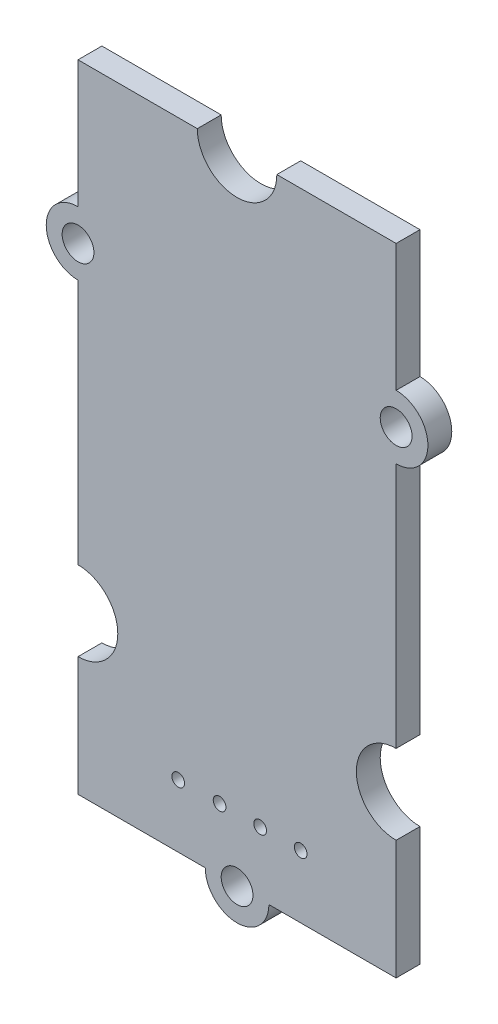
ISO-10303-21;
HEADER;
FILE_DESCRIPTION(('STEP AP214'),'2;1');
FILE_NAME('part.step','',(''),(''),'','','');
FILE_SCHEMA(('AUTOMOTIVE_DESIGN { 1 0 10303 214 1 1 1 1 }'));
ENDSEC;
DATA;
#1=APPLICATION_CONTEXT('core data for automotive mechanical design processes');
#2=APPLICATION_PROTOCOL_DEFINITION('international standard','automotive_design',2000,#1);
#3=PRODUCT_CONTEXT('',#1,'mechanical');
#4=PRODUCT('Part','Part','',(#3));
#5=PRODUCT_RELATED_PRODUCT_CATEGORY('part','',(#4));
#6=PRODUCT_DEFINITION_FORMATION('','',#4);
#7=PRODUCT_DEFINITION_CONTEXT('part definition',#1,'design');
#8=PRODUCT_DEFINITION('design','',#6,#7);
#9=PRODUCT_DEFINITION_SHAPE('','',#8);
#10=(LENGTH_UNIT() NAMED_UNIT(*) SI_UNIT(.MILLI.,.METRE.));
#11=(NAMED_UNIT(*) PLANE_ANGLE_UNIT() SI_UNIT($,.RADIAN.));
#12=(NAMED_UNIT(*) SI_UNIT($,.STERADIAN.) SOLID_ANGLE_UNIT());
#13=UNCERTAINTY_MEASURE_WITH_UNIT(LENGTH_MEASURE(1.E-05),#10,'distance_accuracy_value','');
#14=(GEOMETRIC_REPRESENTATION_CONTEXT(3) GLOBAL_UNCERTAINTY_ASSIGNED_CONTEXT((#13)) GLOBAL_UNIT_ASSIGNED_CONTEXT((#10,
#11,#12)) REPRESENTATION_CONTEXT('',''));
#15=CARTESIAN_POINT('',(0.,0.,0.));
#16=DIRECTION('',(0.,0.,1.));
#17=DIRECTION('',(1.,0.,0.));
#18=AXIS2_PLACEMENT_3D('',#15,#16,#17);
#19=CARTESIAN_POINT('',(-10.,0.,1.5));
#20=DIRECTION('',(1.,0.,0.));
#21=DIRECTION('',(0.,0.,-1.));
#22=AXIS2_PLACEMENT_3D('',#19,#20,#21);
#23=PLANE('',#22);
#24=DIRECTION('',(0.,-1.,0.));
#25=VECTOR('',#24,1.);
#26=CARTESIAN_POINT('',(-10.,0.,0.));
#27=LINE('',#26,#25);
#28=CARTESIAN_POINT('',(-10.,7.5,0.));
#29=VERTEX_POINT('',#28);
#30=CARTESIAN_POINT('',(-10.,0.,0.));
#31=VERTEX_POINT('',#30);
#32=EDGE_CURVE('E180',#29,#31,#27,.T.);
#33=ORIENTED_EDGE('',*,*,#32,.T.);
#34=DIRECTION('',(0.,0.,-1.));
#35=VECTOR('',#34,1.);
#36=CARTESIAN_POINT('',(-10.,0.,1.5));
#37=LINE('',#36,#35);
#38=CARTESIAN_POINT('',(-10.,0.,1.5));
#39=VERTEX_POINT('',#38);
#40=EDGE_CURVE('E11',#39,#31,#37,.T.);
#41=ORIENTED_EDGE('',*,*,#40,.F.);
#42=DIRECTION('',(0.,-1.,0.));
#43=VECTOR('',#42,1.);
#44=CARTESIAN_POINT('',(-10.,0.,1.5));
#45=LINE('',#44,#43);
#46=CARTESIAN_POINT('',(-10.,7.5,1.5));
#47=VERTEX_POINT('',#46);
#48=EDGE_CURVE('E211',#47,#39,#45,.T.);
#49=ORIENTED_EDGE('',*,*,#48,.F.);
#50=DIRECTION('',(0.,0.,-1.));
#51=VECTOR('',#50,1.);
#52=CARTESIAN_POINT('',(-10.,7.5,1.5));
#53=LINE('',#52,#51);
#54=EDGE_CURVE('E176',#47,#29,#53,.T.);
#55=ORIENTED_EDGE('',*,*,#54,.T.);
#56=EDGE_LOOP('',(#33,#41,#49,#55));
#57=FACE_BOUND('',#56,.T.);
#58=ADVANCED_FACE('F36',(#57),#23,.F.);
#59=CARTESIAN_POINT('',(-10.,0.,1.5));
#60=DIRECTION('',(0.,1.,0.));
#61=DIRECTION('',(0.,0.,1.));
#62=AXIS2_PLACEMENT_3D('',#59,#60,#61);
#63=PLANE('',#62);
#64=DIRECTION('',(1.,0.,0.));
#65=VECTOR('',#64,1.);
#66=CARTESIAN_POINT('',(-10.,0.,0.));
#67=LINE('',#66,#65);
#68=CARTESIAN_POINT('',(-2.,0.,0.));
#69=VERTEX_POINT('',#68);
#70=EDGE_CURVE('E183',#31,#69,#67,.T.);
#71=ORIENTED_EDGE('',*,*,#70,.T.);
#72=DIRECTION('',(0.,0.,-1.));
#73=VECTOR('',#72,1.);
#74=CARTESIAN_POINT('',(-2.,0.,1.5));
#75=LINE('',#74,#73);
#76=CARTESIAN_POINT('',(-2.,0.,1.5));
#77=VERTEX_POINT('',#76);
#78=EDGE_CURVE('E44',#77,#69,#75,.T.);
#79=ORIENTED_EDGE('',*,*,#78,.F.);
#80=DIRECTION('',(1.,0.,0.));
#81=VECTOR('',#80,1.);
#82=CARTESIAN_POINT('',(-10.,0.,1.5));
#83=LINE('',#82,#81);
#84=EDGE_CURVE('E119',#39,#77,#83,.T.);
#85=ORIENTED_EDGE('',*,*,#84,.F.);
#86=ORIENTED_EDGE('',*,*,#40,.T.);
#87=EDGE_LOOP('',(#71,#79,#85,#86));
#88=FACE_BOUND('',#87,.T.);
#89=ADVANCED_FACE('F310',(#88),#63,.F.);
#90=CARTESIAN_POINT('',(0.,0.,1.5));
#91=DIRECTION('',(0.,0.,-1.));
#92=DIRECTION('',(-1.,0.,0.));
#93=AXIS2_PLACEMENT_3D('',#90,#91,#92);
#94=CYLINDRICAL_SURFACE('',#93,2.);
#95=CARTESIAN_POINT('',(0.,0.,0.));
#96=DIRECTION('',(0.,0.,1.));
#97=DIRECTION('',(1.,0.,0.));
#98=AXIS2_PLACEMENT_3D('',#95,#96,#97);
#99=CIRCLE('',#98,2.);
#100=CARTESIAN_POINT('',(2.,0.,0.));
#101=VERTEX_POINT('',#100);
#102=EDGE_CURVE('E186',#69,#101,#99,.T.);
#103=ORIENTED_EDGE('',*,*,#102,.T.);
#104=DIRECTION('',(0.,0.,-1.));
#105=VECTOR('',#104,1.);
#106=CARTESIAN_POINT('',(2.,0.,1.5));
#107=LINE('',#106,#105);
#108=CARTESIAN_POINT('',(2.,0.,1.5));
#109=VERTEX_POINT('',#108);
#110=EDGE_CURVE('E242',#109,#101,#107,.T.);
#111=ORIENTED_EDGE('',*,*,#110,.F.);
#112=CARTESIAN_POINT('',(0.,0.,1.5));
#113=DIRECTION('',(0.,0.,1.));
#114=DIRECTION('',(1.,0.,0.));
#115=AXIS2_PLACEMENT_3D('',#112,#113,#114);
#116=CIRCLE('',#115,2.);
#117=EDGE_CURVE('E250',#77,#109,#116,.T.);
#118=ORIENTED_EDGE('',*,*,#117,.F.);
#119=ORIENTED_EDGE('',*,*,#78,.T.);
#120=EDGE_LOOP('',(#103,#111,#118,#119));
#121=FACE_BOUND('',#120,.T.);
#122=ADVANCED_FACE('F248',(#121),#94,.T.);
#123=CARTESIAN_POINT('',(10.,0.,1.5));
#124=DIRECTION('',(0.,1.,0.));
#125=DIRECTION('',(0.,0.,1.));
#126=AXIS2_PLACEMENT_3D('',#123,#124,#125);
#127=PLANE('',#126);
#128=DIRECTION('',(1.,0.,0.));
#129=VECTOR('',#128,1.);
#130=CARTESIAN_POINT('',(10.,0.,0.));
#131=LINE('',#130,#129);
#132=CARTESIAN_POINT('',(10.,0.,0.));
#133=VERTEX_POINT('',#132);
#134=EDGE_CURVE('E188',#101,#133,#131,.T.);
#135=ORIENTED_EDGE('',*,*,#134,.T.);
#136=DIRECTION('',(0.,0.,-1.));
#137=VECTOR('',#136,1.);
#138=CARTESIAN_POINT('',(10.,0.,1.5));
#139=LINE('',#138,#137);
#140=CARTESIAN_POINT('',(10.,0.,1.5));
#141=VERTEX_POINT('',#140);
#142=EDGE_CURVE('E239',#141,#133,#139,.T.);
#143=ORIENTED_EDGE('',*,*,#142,.F.);
#144=DIRECTION('',(1.,0.,0.));
#145=VECTOR('',#144,1.);
#146=CARTESIAN_POINT('',(10.,0.,1.5));
#147=LINE('',#146,#145);
#148=EDGE_CURVE('E268',#109,#141,#147,.T.);
#149=ORIENTED_EDGE('',*,*,#148,.F.);
#150=ORIENTED_EDGE('',*,*,#110,.T.);
#151=EDGE_LOOP('',(#135,#143,#149,#150));
#152=FACE_BOUND('',#151,.T.);
#153=ADVANCED_FACE('F259',(#152),#127,.F.);
#154=CARTESIAN_POINT('',(10.,0.,1.5));
#155=DIRECTION('',(-1.,0.,0.));
#156=DIRECTION('',(0.,0.,1.));
#157=AXIS2_PLACEMENT_3D('',#154,#155,#156);
#158=PLANE('',#157);
#159=DIRECTION('',(0.,1.,0.));
#160=VECTOR('',#159,1.);
#161=CARTESIAN_POINT('',(10.,0.,0.));
#162=LINE('',#161,#160);
#163=CARTESIAN_POINT('',(10.,7.5,0.));
#164=VERTEX_POINT('',#163);
#165=EDGE_CURVE('E190',#133,#164,#162,.T.);
#166=ORIENTED_EDGE('',*,*,#165,.T.);
#167=DIRECTION('',(0.,0.,-1.));
#168=VECTOR('',#167,1.);
#169=CARTESIAN_POINT('',(10.,7.5,1.5));
#170=LINE('',#169,#168);
#171=CARTESIAN_POINT('',(10.,7.5,1.5));
#172=VERTEX_POINT('',#171);
#173=EDGE_CURVE('E236',#172,#164,#170,.T.);
#174=ORIENTED_EDGE('',*,*,#173,.F.);
#175=DIRECTION('',(0.,1.,0.));
#176=VECTOR('',#175,1.);
#177=CARTESIAN_POINT('',(10.,0.,1.5));
#178=LINE('',#177,#176);
#179=EDGE_CURVE('E265',#141,#172,#178,.T.);
#180=ORIENTED_EDGE('',*,*,#179,.F.);
#181=ORIENTED_EDGE('',*,*,#142,.T.);
#182=EDGE_LOOP('',(#166,#174,#180,#181));
#183=FACE_BOUND('',#182,.T.);
#184=ADVANCED_FACE('F263',(#183),#158,.F.);
#185=CARTESIAN_POINT('',(10.,10.,1.5));
#186=DIRECTION('',(0.,0.,-1.));
#187=DIRECTION('',(-1.,0.,0.));
#188=AXIS2_PLACEMENT_3D('',#185,#186,#187);
#189=CYLINDRICAL_SURFACE('',#188,2.5);
#190=CARTESIAN_POINT('',(10.,10.,0.));
#191=DIRECTION('',(0.,0.,-1.));
#192=DIRECTION('',(1.,0.,0.));
#193=AXIS2_PLACEMENT_3D('',#190,#191,#192);
#194=CIRCLE('',#193,2.5);
#195=CARTESIAN_POINT('',(10.,12.5,0.));
#196=VERTEX_POINT('',#195);
#197=EDGE_CURVE('E192',#164,#196,#194,.T.);
#198=ORIENTED_EDGE('',*,*,#197,.T.);
#199=DIRECTION('',(0.,0.,-1.));
#200=VECTOR('',#199,1.);
#201=CARTESIAN_POINT('',(10.,12.5,1.5));
#202=LINE('',#201,#200);
#203=CARTESIAN_POINT('',(10.,12.5,1.5));
#204=VERTEX_POINT('',#203);
#205=EDGE_CURVE('E233',#204,#196,#202,.T.);
#206=ORIENTED_EDGE('',*,*,#205,.F.);
#207=CARTESIAN_POINT('',(10.,10.,1.5));
#208=DIRECTION('',(0.,0.,-1.));
#209=DIRECTION('',(1.,0.,0.));
#210=AXIS2_PLACEMENT_3D('',#207,#208,#209);
#211=CIRCLE('',#210,2.5);
#212=EDGE_CURVE('E267',#172,#204,#211,.T.);
#213=ORIENTED_EDGE('',*,*,#212,.F.);
#214=ORIENTED_EDGE('',*,*,#173,.T.);
#215=EDGE_LOOP('',(#198,#206,#213,#214));
#216=FACE_BOUND('',#215,.T.);
#217=ADVANCED_FACE('F323',(#216),#189,.F.);
#218=CARTESIAN_POINT('',(10.,12.5,1.5));
#219=DIRECTION('',(-1.,0.,0.));
#220=DIRECTION('',(0.,0.,1.));
#221=AXIS2_PLACEMENT_3D('',#218,#219,#220);
#222=PLANE('',#221);
#223=DIRECTION('',(0.,1.,0.));
#224=VECTOR('',#223,1.);
#225=CARTESIAN_POINT('',(10.,12.5,0.));
#226=LINE('',#225,#224);
#227=CARTESIAN_POINT('',(10.,28.,0.));
#228=VERTEX_POINT('',#227);
#229=EDGE_CURVE('E194',#196,#228,#226,.T.);
#230=ORIENTED_EDGE('',*,*,#229,.T.);
#231=DIRECTION('',(0.,0.,-1.));
#232=VECTOR('',#231,1.);
#233=CARTESIAN_POINT('',(10.,28.,1.5));
#234=LINE('',#233,#232);
#235=CARTESIAN_POINT('',(10.,28.,1.5));
#236=VERTEX_POINT('',#235);
#237=EDGE_CURVE('E230',#236,#228,#234,.T.);
#238=ORIENTED_EDGE('',*,*,#237,.F.);
#239=DIRECTION('',(0.,1.,0.));
#240=VECTOR('',#239,1.);
#241=CARTESIAN_POINT('',(10.,12.5,1.5));
#242=LINE('',#241,#240);
#243=EDGE_CURVE('E270',#204,#236,#242,.T.);
#244=ORIENTED_EDGE('',*,*,#243,.F.);
#245=ORIENTED_EDGE('',*,*,#205,.T.);
#246=EDGE_LOOP('',(#230,#238,#244,#245));
#247=FACE_BOUND('',#246,.T.);
#248=ADVANCED_FACE('F326',(#247),#222,.F.);
#249=CARTESIAN_POINT('',(10.,30.,1.5));
#250=DIRECTION('',(0.,0.,-1.));
#251=DIRECTION('',(-1.,0.,0.));
#252=AXIS2_PLACEMENT_3D('',#249,#250,#251);
#253=CYLINDRICAL_SURFACE('',#252,2.);
#254=CARTESIAN_POINT('',(10.,30.,0.));
#255=DIRECTION('',(0.,0.,1.));
#256=DIRECTION('',(-1.,0.,0.));
#257=AXIS2_PLACEMENT_3D('',#254,#255,#256);
#258=CIRCLE('',#257,2.);
#259=CARTESIAN_POINT('',(10.,32.,0.));
#260=VERTEX_POINT('',#259);
#261=EDGE_CURVE('E196',#228,#260,#258,.T.);
#262=ORIENTED_EDGE('',*,*,#261,.T.);
#263=DIRECTION('',(0.,0.,-1.));
#264=VECTOR('',#263,1.);
#265=CARTESIAN_POINT('',(10.,32.,1.5));
#266=LINE('',#265,#264);
#267=CARTESIAN_POINT('',(10.,32.,1.5));
#268=VERTEX_POINT('',#267);
#269=EDGE_CURVE('E227',#268,#260,#266,.T.);
#270=ORIENTED_EDGE('',*,*,#269,.F.);
#271=CARTESIAN_POINT('',(10.,30.,1.5));
#272=DIRECTION('',(0.,0.,1.));
#273=DIRECTION('',(-1.,0.,0.));
#274=AXIS2_PLACEMENT_3D('',#271,#272,#273);
#275=CIRCLE('',#274,2.);
#276=EDGE_CURVE('E276',#236,#268,#275,.T.);
#277=ORIENTED_EDGE('',*,*,#276,.F.);
#278=ORIENTED_EDGE('',*,*,#237,.T.);
#279=EDGE_LOOP('',(#262,#270,#277,#278));
#280=FACE_BOUND('',#279,.T.);
#281=ADVANCED_FACE('F330',(#280),#253,.T.);
#282=CARTESIAN_POINT('',(10.,40.,1.5));
#283=DIRECTION('',(-1.,0.,0.));
#284=DIRECTION('',(0.,0.,1.));
#285=AXIS2_PLACEMENT_3D('',#282,#283,#284);
#286=PLANE('',#285);
#287=DIRECTION('',(0.,1.,0.));
#288=VECTOR('',#287,1.);
#289=CARTESIAN_POINT('',(10.,40.,0.));
#290=LINE('',#289,#288);
#291=CARTESIAN_POINT('',(10.,40.,0.));
#292=VERTEX_POINT('',#291);
#293=EDGE_CURVE('E198',#260,#292,#290,.T.);
#294=ORIENTED_EDGE('',*,*,#293,.T.);
#295=DIRECTION('',(0.,0.,-1.));
#296=VECTOR('',#295,1.);
#297=CARTESIAN_POINT('',(10.,40.,1.5));
#298=LINE('',#297,#296);
#299=CARTESIAN_POINT('',(10.,40.,1.5));
#300=VERTEX_POINT('',#299);
#301=EDGE_CURVE('E224',#300,#292,#298,.T.);
#302=ORIENTED_EDGE('',*,*,#301,.F.);
#303=DIRECTION('',(0.,1.,0.));
#304=VECTOR('',#303,1.);
#305=CARTESIAN_POINT('',(10.,40.,1.5));
#306=LINE('',#305,#304);
#307=EDGE_CURVE('E278',#268,#300,#306,.T.);
#308=ORIENTED_EDGE('',*,*,#307,.F.);
#309=ORIENTED_EDGE('',*,*,#269,.T.);
#310=EDGE_LOOP('',(#294,#302,#308,#309));
#311=FACE_BOUND('',#310,.T.);
#312=ADVANCED_FACE('F334',(#311),#286,.F.);
#313=CARTESIAN_POINT('',(10.,40.,1.5));
#314=DIRECTION('',(0.,-1.,0.));
#315=DIRECTION('',(0.,0.,-1.));
#316=AXIS2_PLACEMENT_3D('',#313,#314,#315);
#317=PLANE('',#316);
#318=DIRECTION('',(-1.,0.,0.));
#319=VECTOR('',#318,1.);
#320=CARTESIAN_POINT('',(10.,40.,0.));
#321=LINE('',#320,#319);
#322=CARTESIAN_POINT('',(2.5,40.,0.));
#323=VERTEX_POINT('',#322);
#324=EDGE_CURVE('E200',#292,#323,#321,.T.);
#325=ORIENTED_EDGE('',*,*,#324,.T.);
#326=DIRECTION('',(0.,0.,-1.));
#327=VECTOR('',#326,1.);
#328=CARTESIAN_POINT('',(2.5,40.,1.5));
#329=LINE('',#328,#327);
#330=CARTESIAN_POINT('',(2.5,40.,1.5));
#331=VERTEX_POINT('',#330);
#332=EDGE_CURVE('E221',#331,#323,#329,.T.);
#333=ORIENTED_EDGE('',*,*,#332,.F.);
#334=DIRECTION('',(-1.,0.,0.));
#335=VECTOR('',#334,1.);
#336=CARTESIAN_POINT('',(10.,40.,1.5));
#337=LINE('',#336,#335);
#338=EDGE_CURVE('E280',#300,#331,#337,.T.);
#339=ORIENTED_EDGE('',*,*,#338,.F.);
#340=ORIENTED_EDGE('',*,*,#301,.T.);
#341=EDGE_LOOP('',(#325,#333,#339,#340));
#342=FACE_BOUND('',#341,.T.);
#343=ADVANCED_FACE('F338',(#342),#317,.F.);
#344=CARTESIAN_POINT('',(0.,40.,1.5));
#345=DIRECTION('',(0.,0.,-1.));
#346=DIRECTION('',(-1.,0.,0.));
#347=AXIS2_PLACEMENT_3D('',#344,#345,#346);
#348=CYLINDRICAL_SURFACE('',#347,2.5);
#349=CARTESIAN_POINT('',(0.,40.,0.));
#350=DIRECTION('',(0.,0.,-1.));
#351=DIRECTION('',(1.,0.,0.));
#352=AXIS2_PLACEMENT_3D('',#349,#350,#351);
#353=CIRCLE('',#352,2.5);
#354=CARTESIAN_POINT('',(-2.5,40.,0.));
#355=VERTEX_POINT('',#354);
#356=EDGE_CURVE('E202',#323,#355,#353,.T.);
#357=ORIENTED_EDGE('',*,*,#356,.T.);
#358=DIRECTION('',(0.,0.,-1.));
#359=VECTOR('',#358,1.);
#360=CARTESIAN_POINT('',(-2.5,40.,1.5));
#361=LINE('',#360,#359);
#362=CARTESIAN_POINT('',(-2.5,40.,1.5));
#363=VERTEX_POINT('',#362);
#364=EDGE_CURVE('E218',#363,#355,#361,.T.);
#365=ORIENTED_EDGE('',*,*,#364,.F.);
#366=CARTESIAN_POINT('',(0.,40.,1.5));
#367=DIRECTION('',(0.,0.,-1.));
#368=DIRECTION('',(1.,0.,0.));
#369=AXIS2_PLACEMENT_3D('',#366,#367,#368);
#370=CIRCLE('',#369,2.5);
#371=EDGE_CURVE('E282',#331,#363,#370,.T.);
#372=ORIENTED_EDGE('',*,*,#371,.F.);
#373=ORIENTED_EDGE('',*,*,#332,.T.);
#374=EDGE_LOOP('',(#357,#365,#372,#373));
#375=FACE_BOUND('',#374,.T.);
#376=ADVANCED_FACE('F342',(#375),#348,.F.);
#377=CARTESIAN_POINT('',(-10.,40.,1.5));
#378=DIRECTION('',(0.,-1.,0.));
#379=DIRECTION('',(0.,0.,-1.));
#380=AXIS2_PLACEMENT_3D('',#377,#378,#379);
#381=PLANE('',#380);
#382=DIRECTION('',(-1.,0.,0.));
#383=VECTOR('',#382,1.);
#384=CARTESIAN_POINT('',(-10.,40.,0.));
#385=LINE('',#384,#383);
#386=CARTESIAN_POINT('',(-10.,40.,0.));
#387=VERTEX_POINT('',#386);
#388=EDGE_CURVE('E204',#355,#387,#385,.T.);
#389=ORIENTED_EDGE('',*,*,#388,.T.);
#390=DIRECTION('',(0.,0.,-1.));
#391=VECTOR('',#390,1.);
#392=CARTESIAN_POINT('',(-10.,40.,1.5));
#393=LINE('',#392,#391);
#394=CARTESIAN_POINT('',(-10.,40.,1.5));
#395=VERTEX_POINT('',#394);
#396=EDGE_CURVE('E215',#395,#387,#393,.T.);
#397=ORIENTED_EDGE('',*,*,#396,.F.);
#398=DIRECTION('',(-1.,0.,0.));
#399=VECTOR('',#398,1.);
#400=CARTESIAN_POINT('',(-10.,40.,1.5));
#401=LINE('',#400,#399);
#402=EDGE_CURVE('E284',#363,#395,#401,.T.);
#403=ORIENTED_EDGE('',*,*,#402,.F.);
#404=ORIENTED_EDGE('',*,*,#364,.T.);
#405=EDGE_LOOP('',(#389,#397,#403,#404));
#406=FACE_BOUND('',#405,.T.);
#407=ADVANCED_FACE('F290',(#406),#381,.F.);
#408=CARTESIAN_POINT('',(-10.,40.,1.5));
#409=DIRECTION('',(1.,0.,0.));
#410=DIRECTION('',(0.,0.,-1.));
#411=AXIS2_PLACEMENT_3D('',#408,#409,#410);
#412=PLANE('',#411);
#413=DIRECTION('',(0.,-1.,0.));
#414=VECTOR('',#413,1.);
#415=CARTESIAN_POINT('',(-10.,40.,0.));
#416=LINE('',#415,#414);
#417=CARTESIAN_POINT('',(-10.,32.,0.));
#418=VERTEX_POINT('',#417);
#419=EDGE_CURVE('E206',#387,#418,#416,.T.);
#420=ORIENTED_EDGE('',*,*,#419,.T.);
#421=DIRECTION('',(0.,0.,-1.));
#422=VECTOR('',#421,1.);
#423=CARTESIAN_POINT('',(-10.,32.,1.5));
#424=LINE('',#423,#422);
#425=CARTESIAN_POINT('',(-10.,32.,1.5));
#426=VERTEX_POINT('',#425);
#427=EDGE_CURVE('E171',#426,#418,#424,.T.);
#428=ORIENTED_EDGE('',*,*,#427,.F.);
#429=DIRECTION('',(0.,-1.,0.));
#430=VECTOR('',#429,1.);
#431=CARTESIAN_POINT('',(-10.,40.,1.5));
#432=LINE('',#431,#430);
#433=EDGE_CURVE('E162',#395,#426,#432,.T.);
#434=ORIENTED_EDGE('',*,*,#433,.F.);
#435=ORIENTED_EDGE('',*,*,#396,.T.);
#436=EDGE_LOOP('',(#420,#428,#434,#435));
#437=FACE_BOUND('',#436,.T.);
#438=ADVANCED_FACE('F294',(#437),#412,.F.);
#439=CARTESIAN_POINT('',(-10.,30.,1.5));
#440=DIRECTION('',(0.,0.,-1.));
#441=DIRECTION('',(-1.,0.,0.));
#442=AXIS2_PLACEMENT_3D('',#439,#440,#441);
#443=CYLINDRICAL_SURFACE('',#442,2.);
#444=CARTESIAN_POINT('',(-10.,30.,0.));
#445=DIRECTION('',(0.,0.,1.));
#446=DIRECTION('',(1.,0.,0.));
#447=AXIS2_PLACEMENT_3D('',#444,#445,#446);
#448=CIRCLE('',#447,2.);
#449=CARTESIAN_POINT('',(-10.,28.,0.));
#450=VERTEX_POINT('',#449);
#451=EDGE_CURVE('E170',#418,#450,#448,.T.);
#452=ORIENTED_EDGE('',*,*,#451,.T.);
#453=DIRECTION('',(0.,0.,-1.));
#454=VECTOR('',#453,1.);
#455=CARTESIAN_POINT('',(-10.,28.,1.5));
#456=LINE('',#455,#454);
#457=CARTESIAN_POINT('',(-10.,28.,1.5));
#458=VERTEX_POINT('',#457);
#459=EDGE_CURVE('E167',#458,#450,#456,.T.);
#460=ORIENTED_EDGE('',*,*,#459,.F.);
#461=CARTESIAN_POINT('',(-10.,30.,1.5));
#462=DIRECTION('',(0.,0.,1.));
#463=DIRECTION('',(1.,0.,0.));
#464=AXIS2_PLACEMENT_3D('',#461,#462,#463);
#465=CIRCLE('',#464,2.);
#466=EDGE_CURVE('E156',#426,#458,#465,.T.);
#467=ORIENTED_EDGE('',*,*,#466,.F.);
#468=ORIENTED_EDGE('',*,*,#427,.T.);
#469=EDGE_LOOP('',(#452,#460,#467,#468));
#470=FACE_BOUND('',#469,.T.);
#471=ADVANCED_FACE('F168',(#470),#443,.T.);
#472=CARTESIAN_POINT('',(-10.,12.5,1.5));
#473=DIRECTION('',(1.,0.,0.));
#474=DIRECTION('',(0.,0.,-1.));
#475=AXIS2_PLACEMENT_3D('',#472,#473,#474);
#476=PLANE('',#475);
#477=DIRECTION('',(0.,-1.,0.));
#478=VECTOR('',#477,1.);
#479=CARTESIAN_POINT('',(-10.,12.5,0.));
#480=LINE('',#479,#478);
#481=CARTESIAN_POINT('',(-10.,12.5,0.));
#482=VERTEX_POINT('',#481);
#483=EDGE_CURVE('E105',#450,#482,#480,.T.);
#484=ORIENTED_EDGE('',*,*,#483,.T.);
#485=DIRECTION('',(0.,0.,-1.));
#486=VECTOR('',#485,1.);
#487=CARTESIAN_POINT('',(-10.,12.5,1.5));
#488=LINE('',#487,#486);
#489=CARTESIAN_POINT('',(-10.,12.5,1.5));
#490=VERTEX_POINT('',#489);
#491=EDGE_CURVE('E172',#490,#482,#488,.T.);
#492=ORIENTED_EDGE('',*,*,#491,.F.);
#493=DIRECTION('',(0.,-1.,0.));
#494=VECTOR('',#493,1.);
#495=CARTESIAN_POINT('',(-10.,12.5,1.5));
#496=LINE('',#495,#494);
#497=EDGE_CURVE('E160',#458,#490,#496,.T.);
#498=ORIENTED_EDGE('',*,*,#497,.F.);
#499=ORIENTED_EDGE('',*,*,#459,.T.);
#500=EDGE_LOOP('',(#484,#492,#498,#499));
#501=FACE_BOUND('',#500,.T.);
#502=ADVANCED_FACE('F174',(#501),#476,.F.);
#503=CARTESIAN_POINT('',(-10.,10.,1.5));
#504=DIRECTION('',(0.,0.,-1.));
#505=DIRECTION('',(-1.,0.,0.));
#506=AXIS2_PLACEMENT_3D('',#503,#504,#505);
#507=CYLINDRICAL_SURFACE('',#506,2.5);
#508=CARTESIAN_POINT('',(-10.,10.,0.));
#509=DIRECTION('',(0.,0.,-1.));
#510=DIRECTION('',(-1.,0.,0.));
#511=AXIS2_PLACEMENT_3D('',#508,#509,#510);
#512=CIRCLE('',#511,2.5);
#513=EDGE_CURVE('E111',#482,#29,#512,.T.);
#514=ORIENTED_EDGE('',*,*,#513,.T.);
#515=ORIENTED_EDGE('',*,*,#54,.F.);
#516=CARTESIAN_POINT('',(-10.,10.,1.5));
#517=DIRECTION('',(0.,0.,-1.));
#518=DIRECTION('',(-1.,0.,0.));
#519=AXIS2_PLACEMENT_3D('',#516,#517,#518);
#520=CIRCLE('',#519,2.5);
#521=EDGE_CURVE('E52',#490,#47,#520,.T.);
#522=ORIENTED_EDGE('',*,*,#521,.F.);
#523=ORIENTED_EDGE('',*,*,#491,.T.);
#524=EDGE_LOOP('',(#514,#515,#522,#523));
#525=FACE_BOUND('',#524,.T.);
#526=ADVANCED_FACE('F298',(#525),#507,.F.);
#527=CARTESIAN_POINT('',(-10.,10.,1.5));
#528=DIRECTION('',(0.,0.,-1.));
#529=DIRECTION('',(-1.,0.,0.));
#530=AXIS2_PLACEMENT_3D('',#527,#528,#529);
#531=PLANE('',#530);
#532=CARTESIAN_POINT('',(-3.7,3.94341720128032,1.5));
#533=DIRECTION('',(0.,0.,1.));
#534=DIRECTION('',(1.,0.,0.));
#535=AXIS2_PLACEMENT_3D('',#532,#533,#534);
#536=CIRCLE('',#535,0.4);
#537=CARTESIAN_POINT('',(-3.3,3.94341720128032,1.5));
#538=VERTEX_POINT('',#537);
#539=EDGE_CURVE('E460',#538,#538,#536,.T.);
#540=ORIENTED_EDGE('',*,*,#539,.F.);
#541=EDGE_LOOP('',(#540));
#542=FACE_BOUND('',#541,.T.);
#543=CARTESIAN_POINT('',(-1.1,3.94341720128032,1.5));
#544=DIRECTION('',(0.,0.,1.));
#545=DIRECTION('',(1.,0.,0.));
#546=AXIS2_PLACEMENT_3D('',#543,#544,#545);
#547=CIRCLE('',#546,0.4);
#548=CARTESIAN_POINT('',(-0.699999999999996,3.94341720128032,1.5));
#549=VERTEX_POINT('',#548);
#550=EDGE_CURVE('E462',#549,#549,#547,.T.);
#551=ORIENTED_EDGE('',*,*,#550,.F.);
#552=EDGE_LOOP('',(#551));
#553=FACE_BOUND('',#552,.T.);
#554=CARTESIAN_POINT('',(1.45,3.94341720128032,1.5));
#555=DIRECTION('',(0.,0.,1.));
#556=DIRECTION('',(1.,0.,0.));
#557=AXIS2_PLACEMENT_3D('',#554,#555,#556);
#558=CIRCLE('',#557,0.4);
#559=CARTESIAN_POINT('',(1.85,3.94341720128032,1.5));
#560=VERTEX_POINT('',#559);
#561=EDGE_CURVE('E468',#560,#560,#558,.T.);
#562=ORIENTED_EDGE('',*,*,#561,.F.);
#563=EDGE_LOOP('',(#562));
#564=FACE_BOUND('',#563,.T.);
#565=CARTESIAN_POINT('',(4.,3.94341720128032,1.5));
#566=DIRECTION('',(0.,0.,1.));
#567=DIRECTION('',(1.,0.,0.));
#568=AXIS2_PLACEMENT_3D('',#565,#566,#567);
#569=CIRCLE('',#568,0.4);
#570=CARTESIAN_POINT('',(4.4,3.94341720128032,1.5));
#571=VERTEX_POINT('',#570);
#572=EDGE_CURVE('E474',#571,#571,#569,.T.);
#573=ORIENTED_EDGE('',*,*,#572,.F.);
#574=EDGE_LOOP('',(#573));
#575=FACE_BOUND('',#574,.T.);
#576=CARTESIAN_POINT('',(0.,0.,1.5));
#577=DIRECTION('',(0.,0.,1.));
#578=DIRECTION('',(1.,0.,0.));
#579=AXIS2_PLACEMENT_3D('',#576,#577,#578);
#580=CIRCLE('',#579,1.);
#581=CARTESIAN_POINT('',(1.,0.,1.5));
#582=VERTEX_POINT('',#581);
#583=EDGE_CURVE('E480',#582,#582,#580,.T.);
#584=ORIENTED_EDGE('',*,*,#583,.F.);
#585=EDGE_LOOP('',(#584));
#586=FACE_BOUND('',#585,.T.);
#587=CARTESIAN_POINT('',(10.,30.,1.5));
#588=DIRECTION('',(0.,0.,1.));
#589=DIRECTION('',(-1.,0.,0.));
#590=AXIS2_PLACEMENT_3D('',#587,#588,#589);
#591=CIRCLE('',#590,1.);
#592=CARTESIAN_POINT('',(9.,30.,1.5));
#593=VERTEX_POINT('',#592);
#594=EDGE_CURVE('E486',#593,#593,#591,.T.);
#595=ORIENTED_EDGE('',*,*,#594,.F.);
#596=EDGE_LOOP('',(#595));
#597=FACE_BOUND('',#596,.T.);
#598=CARTESIAN_POINT('',(-10.,30.,1.5));
#599=DIRECTION('',(0.,0.,1.));
#600=DIRECTION('',(1.,0.,0.));
#601=AXIS2_PLACEMENT_3D('',#598,#599,#600);
#602=CIRCLE('',#601,1.);
#603=CARTESIAN_POINT('',(-9.,30.,1.5));
#604=VERTEX_POINT('',#603);
#605=EDGE_CURVE('E492',#604,#604,#602,.T.);
#606=ORIENTED_EDGE('',*,*,#605,.F.);
#607=EDGE_LOOP('',(#606));
#608=FACE_BOUND('',#607,.T.);
#609=ORIENTED_EDGE('',*,*,#48,.T.);
#610=ORIENTED_EDGE('',*,*,#84,.T.);
#611=ORIENTED_EDGE('',*,*,#117,.T.);
#612=ORIENTED_EDGE('',*,*,#148,.T.);
#613=ORIENTED_EDGE('',*,*,#179,.T.);
#614=ORIENTED_EDGE('',*,*,#212,.T.);
#615=ORIENTED_EDGE('',*,*,#243,.T.);
#616=ORIENTED_EDGE('',*,*,#276,.T.);
#617=ORIENTED_EDGE('',*,*,#307,.T.);
#618=ORIENTED_EDGE('',*,*,#338,.T.);
#619=ORIENTED_EDGE('',*,*,#371,.T.);
#620=ORIENTED_EDGE('',*,*,#402,.T.);
#621=ORIENTED_EDGE('',*,*,#433,.T.);
#622=ORIENTED_EDGE('',*,*,#466,.T.);
#623=ORIENTED_EDGE('',*,*,#497,.T.);
#624=ORIENTED_EDGE('',*,*,#521,.T.);
#625=EDGE_LOOP('',(#609,#610,#611,#612,#613,#614,#615,#616,#617,#618,#619,#620,#621,#622,#623,#624));
#626=FACE_BOUND('',#625,.T.);
#627=ADVANCED_FACE('F158',(#542,#553,#564,#575,#586,#597,#608,#626),#531,.F.);
#628=CARTESIAN_POINT('',(-10.,10.,0.));
#629=DIRECTION('',(0.,0.,-1.));
#630=DIRECTION('',(-1.,0.,0.));
#631=AXIS2_PLACEMENT_3D('',#628,#629,#630);
#632=PLANE('',#631);
#633=CARTESIAN_POINT('',(-3.7,3.94341720128032,0.));
#634=DIRECTION('',(0.,0.,1.));
#635=DIRECTION('',(1.,0.,0.));
#636=AXIS2_PLACEMENT_3D('',#633,#634,#635);
#637=CIRCLE('',#636,0.4);
#638=CARTESIAN_POINT('',(-3.3,3.94341720128032,0.));
#639=VERTEX_POINT('',#638);
#640=EDGE_CURVE('E457',#639,#639,#637,.T.);
#641=ORIENTED_EDGE('',*,*,#640,.T.);
#642=EDGE_LOOP('',(#641));
#643=FACE_BOUND('',#642,.T.);
#644=CARTESIAN_POINT('',(-1.1,3.94341720128032,0.));
#645=DIRECTION('',(0.,0.,1.));
#646=DIRECTION('',(1.,0.,0.));
#647=AXIS2_PLACEMENT_3D('',#644,#645,#646);
#648=CIRCLE('',#647,0.4);
#649=CARTESIAN_POINT('',(-0.699999999999996,3.94341720128032,0.));
#650=VERTEX_POINT('',#649);
#651=EDGE_CURVE('E465',#650,#650,#648,.T.);
#652=ORIENTED_EDGE('',*,*,#651,.T.);
#653=EDGE_LOOP('',(#652));
#654=FACE_BOUND('',#653,.T.);
#655=CARTESIAN_POINT('',(1.45,3.94341720128032,0.));
#656=DIRECTION('',(0.,0.,1.));
#657=DIRECTION('',(1.,0.,0.));
#658=AXIS2_PLACEMENT_3D('',#655,#656,#657);
#659=CIRCLE('',#658,0.4);
#660=CARTESIAN_POINT('',(1.85,3.94341720128032,0.));
#661=VERTEX_POINT('',#660);
#662=EDGE_CURVE('E471',#661,#661,#659,.T.);
#663=ORIENTED_EDGE('',*,*,#662,.T.);
#664=EDGE_LOOP('',(#663));
#665=FACE_BOUND('',#664,.T.);
#666=CARTESIAN_POINT('',(4.,3.94341720128032,0.));
#667=DIRECTION('',(0.,0.,1.));
#668=DIRECTION('',(1.,0.,0.));
#669=AXIS2_PLACEMENT_3D('',#666,#667,#668);
#670=CIRCLE('',#669,0.4);
#671=CARTESIAN_POINT('',(4.4,3.94341720128032,0.));
#672=VERTEX_POINT('',#671);
#673=EDGE_CURVE('E477',#672,#672,#670,.T.);
#674=ORIENTED_EDGE('',*,*,#673,.T.);
#675=EDGE_LOOP('',(#674));
#676=FACE_BOUND('',#675,.T.);
#677=CARTESIAN_POINT('',(0.,0.,0.));
#678=DIRECTION('',(0.,0.,1.));
#679=DIRECTION('',(1.,0.,0.));
#680=AXIS2_PLACEMENT_3D('',#677,#678,#679);
#681=CIRCLE('',#680,1.);
#682=CARTESIAN_POINT('',(1.,0.,0.));
#683=VERTEX_POINT('',#682);
#684=EDGE_CURVE('E483',#683,#683,#681,.T.);
#685=ORIENTED_EDGE('',*,*,#684,.T.);
#686=EDGE_LOOP('',(#685));
#687=FACE_BOUND('',#686,.T.);
#688=CARTESIAN_POINT('',(10.,30.,0.));
#689=DIRECTION('',(0.,0.,1.));
#690=DIRECTION('',(-1.,0.,0.));
#691=AXIS2_PLACEMENT_3D('',#688,#689,#690);
#692=CIRCLE('',#691,1.);
#693=CARTESIAN_POINT('',(9.,30.,0.));
#694=VERTEX_POINT('',#693);
#695=EDGE_CURVE('E489',#694,#694,#692,.T.);
#696=ORIENTED_EDGE('',*,*,#695,.T.);
#697=EDGE_LOOP('',(#696));
#698=FACE_BOUND('',#697,.T.);
#699=CARTESIAN_POINT('',(-10.,30.,0.));
#700=DIRECTION('',(0.,0.,1.));
#701=DIRECTION('',(1.,0.,0.));
#702=AXIS2_PLACEMENT_3D('',#699,#700,#701);
#703=CIRCLE('',#702,1.);
#704=CARTESIAN_POINT('',(-9.,30.,0.));
#705=VERTEX_POINT('',#704);
#706=EDGE_CURVE('E184',#705,#705,#703,.T.);
#707=ORIENTED_EDGE('',*,*,#706,.T.);
#708=EDGE_LOOP('',(#707));
#709=FACE_BOUND('',#708,.T.);
#710=ORIENTED_EDGE('',*,*,#32,.F.);
#711=ORIENTED_EDGE('',*,*,#513,.F.);
#712=ORIENTED_EDGE('',*,*,#483,.F.);
#713=ORIENTED_EDGE('',*,*,#451,.F.);
#714=ORIENTED_EDGE('',*,*,#419,.F.);
#715=ORIENTED_EDGE('',*,*,#388,.F.);
#716=ORIENTED_EDGE('',*,*,#356,.F.);
#717=ORIENTED_EDGE('',*,*,#324,.F.);
#718=ORIENTED_EDGE('',*,*,#293,.F.);
#719=ORIENTED_EDGE('',*,*,#261,.F.);
#720=ORIENTED_EDGE('',*,*,#229,.F.);
#721=ORIENTED_EDGE('',*,*,#197,.F.);
#722=ORIENTED_EDGE('',*,*,#165,.F.);
#723=ORIENTED_EDGE('',*,*,#134,.F.);
#724=ORIENTED_EDGE('',*,*,#102,.F.);
#725=ORIENTED_EDGE('',*,*,#70,.F.);
#726=EDGE_LOOP('',(#710,#711,#712,#713,#714,#715,#716,#717,#718,#719,#720,#721,#722,#723,#724,#725));
#727=FACE_BOUND('',#726,.T.);
#728=ADVANCED_FACE('F254',(#643,#654,#665,#676,#687,#698,#709,#727),#632,.T.);
#729=CARTESIAN_POINT('',(-10.,30.,0.));
#730=DIRECTION('',(0.,0.,1.));
#731=DIRECTION('',(1.,0.,0.));
#732=AXIS2_PLACEMENT_3D('',#729,#730,#731);
#733=CYLINDRICAL_SURFACE('',#732,1.);
#734=ORIENTED_EDGE('',*,*,#706,.F.);
#735=EDGE_LOOP('',(#734));
#736=FACE_BOUND('',#735,.T.);
#737=ORIENTED_EDGE('',*,*,#605,.T.);
#738=EDGE_LOOP('',(#737));
#739=FACE_BOUND('',#738,.T.);
#740=ADVANCED_FACE('F381',(#736,#739),#733,.F.);
#741=CARTESIAN_POINT('',(10.,30.,0.));
#742=DIRECTION('',(0.,0.,1.));
#743=DIRECTION('',(1.,0.,0.));
#744=AXIS2_PLACEMENT_3D('',#741,#742,#743);
#745=CYLINDRICAL_SURFACE('',#744,1.);
#746=ORIENTED_EDGE('',*,*,#695,.F.);
#747=EDGE_LOOP('',(#746));
#748=FACE_BOUND('',#747,.T.);
#749=ORIENTED_EDGE('',*,*,#594,.T.);
#750=EDGE_LOOP('',(#749));
#751=FACE_BOUND('',#750,.T.);
#752=ADVANCED_FACE('F390',(#748,#751),#745,.F.);
#753=CARTESIAN_POINT('',(0.,0.,0.));
#754=DIRECTION('',(0.,0.,1.));
#755=DIRECTION('',(1.,0.,0.));
#756=AXIS2_PLACEMENT_3D('',#753,#754,#755);
#757=CYLINDRICAL_SURFACE('',#756,1.);
#758=ORIENTED_EDGE('',*,*,#684,.F.);
#759=EDGE_LOOP('',(#758));
#760=FACE_BOUND('',#759,.T.);
#761=ORIENTED_EDGE('',*,*,#583,.T.);
#762=EDGE_LOOP('',(#761));
#763=FACE_BOUND('',#762,.T.);
#764=ADVANCED_FACE('F400',(#760,#763),#757,.F.);
#765=CARTESIAN_POINT('',(4.,3.94341720128032,0.));
#766=DIRECTION('',(0.,0.,1.));
#767=DIRECTION('',(1.,0.,0.));
#768=AXIS2_PLACEMENT_3D('',#765,#766,#767);
#769=CYLINDRICAL_SURFACE('',#768,0.4);
#770=ORIENTED_EDGE('',*,*,#673,.F.);
#771=EDGE_LOOP('',(#770));
#772=FACE_BOUND('',#771,.T.);
#773=ORIENTED_EDGE('',*,*,#572,.T.);
#774=EDGE_LOOP('',(#773));
#775=FACE_BOUND('',#774,.T.);
#776=ADVANCED_FACE('F410',(#772,#775),#769,.F.);
#777=CARTESIAN_POINT('',(1.45,3.94341720128032,0.));
#778=DIRECTION('',(0.,0.,1.));
#779=DIRECTION('',(1.,0.,0.));
#780=AXIS2_PLACEMENT_3D('',#777,#778,#779);
#781=CYLINDRICAL_SURFACE('',#780,0.4);
#782=ORIENTED_EDGE('',*,*,#662,.F.);
#783=EDGE_LOOP('',(#782));
#784=FACE_BOUND('',#783,.T.);
#785=ORIENTED_EDGE('',*,*,#561,.T.);
#786=EDGE_LOOP('',(#785));
#787=FACE_BOUND('',#786,.T.);
#788=ADVANCED_FACE('F420',(#784,#787),#781,.F.);
#789=CARTESIAN_POINT('',(-1.1,3.94341720128032,0.));
#790=DIRECTION('',(0.,0.,1.));
#791=DIRECTION('',(1.,0.,0.));
#792=AXIS2_PLACEMENT_3D('',#789,#790,#791);
#793=CYLINDRICAL_SURFACE('',#792,0.4);
#794=ORIENTED_EDGE('',*,*,#651,.F.);
#795=EDGE_LOOP('',(#794));
#796=FACE_BOUND('',#795,.T.);
#797=ORIENTED_EDGE('',*,*,#550,.T.);
#798=EDGE_LOOP('',(#797));
#799=FACE_BOUND('',#798,.T.);
#800=ADVANCED_FACE('F430',(#796,#799),#793,.F.);
#801=CARTESIAN_POINT('',(-3.7,3.94341720128032,0.));
#802=DIRECTION('',(0.,0.,1.));
#803=DIRECTION('',(1.,0.,0.));
#804=AXIS2_PLACEMENT_3D('',#801,#802,#803);
#805=CYLINDRICAL_SURFACE('',#804,0.4);
#806=ORIENTED_EDGE('',*,*,#640,.F.);
#807=EDGE_LOOP('',(#806));
#808=FACE_BOUND('',#807,.T.);
#809=ORIENTED_EDGE('',*,*,#539,.T.);
#810=EDGE_LOOP('',(#809));
#811=FACE_BOUND('',#810,.T.);
#812=ADVANCED_FACE('F440',(#808,#811),#805,.F.);
#813=CLOSED_SHELL('',(#58,#89,#122,#153,#184,#217,#248,#281,#312,#343,#376,#407,#438,#471,#502,
#526,#627,#728,#740,#752,#764,#776,#788,#800,#812));
#814=MANIFOLD_SOLID_BREP('B2',#813);
#815=ADVANCED_BREP_SHAPE_REPRESENTATION('',(#18,#814),#14);
#816=SHAPE_DEFINITION_REPRESENTATION(#9,#815);
ENDSEC;
END-ISO-10303-21;
